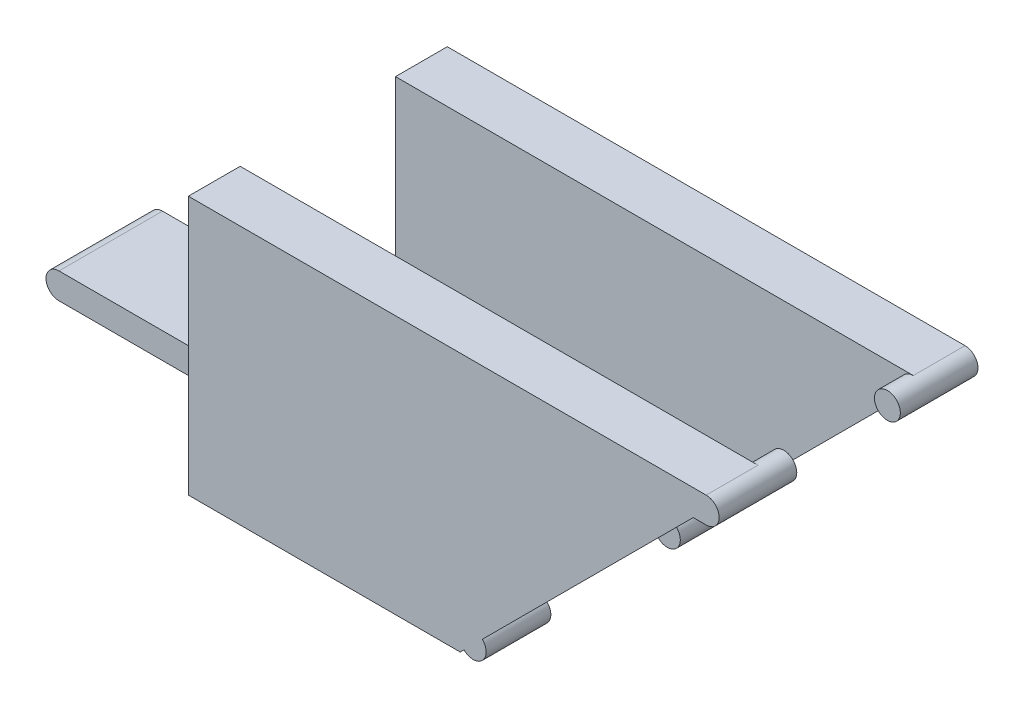
ISO-10303-21;
HEADER;
FILE_DESCRIPTION(('STEP AP214'),'2;1');
FILE_NAME('part.step','',(''),(''),'','','');
FILE_SCHEMA(('AUTOMOTIVE_DESIGN { 1 0 10303 214 1 1 1 1 }'));
ENDSEC;
DATA;
#1=APPLICATION_CONTEXT('core data for automotive mechanical design processes');
#2=APPLICATION_PROTOCOL_DEFINITION('international standard','automotive_design',2000,#1);
#3=PRODUCT_CONTEXT('',#1,'mechanical');
#4=PRODUCT('Part','Part','',(#3));
#5=PRODUCT_RELATED_PRODUCT_CATEGORY('part','',(#4));
#6=PRODUCT_DEFINITION_FORMATION('','',#4);
#7=PRODUCT_DEFINITION_CONTEXT('part definition',#1,'design');
#8=PRODUCT_DEFINITION('design','',#6,#7);
#9=PRODUCT_DEFINITION_SHAPE('','',#8);
#10=(LENGTH_UNIT() NAMED_UNIT(*) SI_UNIT(.MILLI.,.METRE.));
#11=(NAMED_UNIT(*) PLANE_ANGLE_UNIT() SI_UNIT($,.RADIAN.));
#12=(NAMED_UNIT(*) SI_UNIT($,.STERADIAN.) SOLID_ANGLE_UNIT());
#13=UNCERTAINTY_MEASURE_WITH_UNIT(LENGTH_MEASURE(1.E-05),#10,'distance_accuracy_value','');
#14=(GEOMETRIC_REPRESENTATION_CONTEXT(3) GLOBAL_UNCERTAINTY_ASSIGNED_CONTEXT((#13)) GLOBAL_UNIT_ASSIGNED_CONTEXT((#10,
#11,#12)) REPRESENTATION_CONTEXT('',''));
#15=CARTESIAN_POINT('',(0.,0.,0.));
#16=DIRECTION('',(0.,0.,1.));
#17=DIRECTION('',(1.,0.,0.));
#18=AXIS2_PLACEMENT_3D('',#15,#16,#17);
#19=CARTESIAN_POINT('',(37.,18.,-10.));
#20=DIRECTION('',(-0.707106781186553,0.707106781186542,0.));
#21=DIRECTION('',(-0.707106781186542,-0.707106781186553,0.));
#22=AXIS2_PLACEMENT_3D('',#19,#20,#21);
#23=PLANE('',#22);
#24=DIRECTION('',(0.707106781186542,0.707106781186553,0.));
#25=VECTOR('',#24,1.);
#26=CARTESIAN_POINT('',(39.6624393450778,20.6624393450778,-6.));
#27=LINE('',#26,#25);
#28=CARTESIAN_POINT('',(20.7071067811867,1.7071067811864,-6.));
#29=VERTEX_POINT('',#28);
#30=CARTESIAN_POINT('',(37.,18.,-6.));
#31=VERTEX_POINT('',#30);
#32=EDGE_CURVE('E210',#29,#31,#27,.T.);
#33=ORIENTED_EDGE('',*,*,#32,.F.);
#34=DIRECTION('',(0.,0.,-1.));
#35=VECTOR('',#34,1.);
#36=CARTESIAN_POINT('',(20.7071067811867,1.7071067811864,-5.));
#37=LINE('',#36,#35);
#38=CARTESIAN_POINT('',(20.7071067811867,1.7071067811864,-10.));
#39=VERTEX_POINT('',#38);
#40=EDGE_CURVE('E11',#29,#39,#37,.T.);
#41=ORIENTED_EDGE('',*,*,#40,.T.);
#42=DIRECTION('',(-0.707106781186542,-0.707106781186553,0.));
#43=VECTOR('',#42,1.);
#44=CARTESIAN_POINT('',(37.,18.,-10.));
#45=LINE('',#44,#43);
#46=CARTESIAN_POINT('',(37.,18.,-10.));
#47=VERTEX_POINT('',#46);
#48=EDGE_CURVE('E208',#47,#39,#45,.T.);
#49=ORIENTED_EDGE('',*,*,#48,.F.);
#50=DIRECTION('',(0.,0.,1.));
#51=VECTOR('',#50,1.);
#52=CARTESIAN_POINT('',(37.,18.,-10.));
#53=LINE('',#52,#51);
#54=EDGE_CURVE('E227',#47,#31,#53,.T.);
#55=ORIENTED_EDGE('',*,*,#54,.T.);
#56=EDGE_LOOP('',(#33,#41,#49,#55));
#57=FACE_BOUND('',#56,.T.);
#58=ADVANCED_FACE('F38',(#57),#23,.F.);
#59=DIRECTION('',(-0.707106781186542,-0.707106781186553,0.));
#60=VECTOR('',#59,1.);
#61=CARTESIAN_POINT('',(39.6624393450778,20.6624393450778,6.));
#62=LINE('',#61,#60);
#63=CARTESIAN_POINT('',(19.2928932188136,0.292893218813289,6.));
#64=VERTEX_POINT('',#63);
#65=CARTESIAN_POINT('',(19.0000000000003,0.,6.));
#66=VERTEX_POINT('',#65);
#67=EDGE_CURVE('E368',#64,#66,#62,.T.);
#68=ORIENTED_EDGE('',*,*,#67,.F.);
#69=DIRECTION('',(0.,0.,1.));
#70=VECTOR('',#69,1.);
#71=CARTESIAN_POINT('',(19.2928932188136,0.292893218813291,5.));
#72=LINE('',#71,#70);
#73=CARTESIAN_POINT('',(19.2928932188136,0.292893218813291,10.));
#74=VERTEX_POINT('',#73);
#75=EDGE_CURVE('E373',#64,#74,#72,.T.);
#76=ORIENTED_EDGE('',*,*,#75,.T.);
#77=DIRECTION('',(-0.707106781186542,-0.707106781186553,0.));
#78=VECTOR('',#77,1.);
#79=CARTESIAN_POINT('',(37.,18.,10.));
#80=LINE('',#79,#78);
#81=CARTESIAN_POINT('',(19.0000000000003,0.,10.));
#82=VERTEX_POINT('',#81);
#83=EDGE_CURVE('E224',#74,#82,#80,.T.);
#84=ORIENTED_EDGE('',*,*,#83,.T.);
#85=DIRECTION('',(0.,0.,1.));
#86=VECTOR('',#85,1.);
#87=CARTESIAN_POINT('',(19.0000000000003,0.,-10.));
#88=LINE('',#87,#86);
#89=EDGE_CURVE('E216',#66,#82,#88,.T.);
#90=ORIENTED_EDGE('',*,*,#89,.F.);
#91=EDGE_LOOP('',(#68,#76,#84,#90));
#92=FACE_BOUND('',#91,.T.);
#93=ADVANCED_FACE('F486',(#92),#23,.F.);
#94=CARTESIAN_POINT('',(38.,19.,10.));
#95=DIRECTION('',(0.,0.,-1.));
#96=DIRECTION('',(-1.,0.,0.));
#97=AXIS2_PLACEMENT_3D('',#94,#95,#96);
#98=CYLINDRICAL_SURFACE('',#97,0.999999999999998);
#99=CARTESIAN_POINT('',(38.,19.,4.00000000000001));
#100=DIRECTION('',(0.,0.,1.));
#101=DIRECTION('',(1.,0.,0.));
#102=AXIS2_PLACEMENT_3D('',#99,#100,#101);
#103=CIRCLE('',#102,0.999999999999998);
#104=CARTESIAN_POINT('',(39.,19.,4.00000000000001));
#105=VERTEX_POINT('',#104);
#106=EDGE_CURVE('E266',#105,#105,#103,.T.);
#107=ORIENTED_EDGE('',*,*,#106,.T.);
#108=EDGE_LOOP('',(#107));
#109=FACE_BOUND('',#108,.T.);
#110=CARTESIAN_POINT('',(38.,19.,10.));
#111=DIRECTION('',(0.,0.,1.));
#112=DIRECTION('',(1.,0.,0.));
#113=AXIS2_PLACEMENT_3D('',#110,#111,#112);
#114=CIRCLE('',#113,0.999999999999998);
#115=CARTESIAN_POINT('',(38.,18.,10.));
#116=VERTEX_POINT('',#115);
#117=CARTESIAN_POINT('',(38.,20.,10.));
#118=VERTEX_POINT('',#117);
#119=EDGE_CURVE('E270',#116,#118,#114,.T.);
#120=ORIENTED_EDGE('',*,*,#119,.F.);
#121=DIRECTION('',(0.,0.,-1.));
#122=VECTOR('',#121,1.);
#123=CARTESIAN_POINT('',(38.,18.,10.));
#124=LINE('',#123,#122);
#125=CARTESIAN_POINT('',(38.,18.,6.));
#126=VERTEX_POINT('',#125);
#127=EDGE_CURVE('E273',#116,#126,#124,.T.);
#128=ORIENTED_EDGE('',*,*,#127,.T.);
#129=CARTESIAN_POINT('',(38.,19.,6.));
#130=DIRECTION('',(0.,0.,1.));
#131=DIRECTION('',(0.,-1.,0.));
#132=AXIS2_PLACEMENT_3D('',#129,#130,#131);
#133=CIRCLE('',#132,0.999999999999998);
#134=CARTESIAN_POINT('',(38.,20.,6.));
#135=VERTEX_POINT('',#134);
#136=EDGE_CURVE('E362',#126,#135,#133,.F.);
#137=ORIENTED_EDGE('',*,*,#136,.T.);
#138=DIRECTION('',(0.,0.,-1.));
#139=VECTOR('',#138,1.);
#140=CARTESIAN_POINT('',(38.,20.,-10.));
#141=LINE('',#140,#139);
#142=EDGE_CURVE('E339',#118,#135,#141,.T.);
#143=ORIENTED_EDGE('',*,*,#142,.F.);
#144=EDGE_LOOP('',(#120,#128,#137,#143));
#145=FACE_BOUND('',#144,.T.);
#146=ADVANCED_FACE('F453',(#109,#145),#98,.T.);
#147=CARTESIAN_POINT('',(-18.,4.,-4.));
#148=DIRECTION('',(0.,-1.,0.));
#149=DIRECTION('',(0.,0.,-1.));
#150=AXIS2_PLACEMENT_3D('',#147,#148,#149);
#151=PLANE('',#150);
#152=DIRECTION('',(0.,0.,1.));
#153=VECTOR('',#152,1.);
#154=CARTESIAN_POINT('',(18.,4.,5.99999999999999));
#155=LINE('',#154,#153);
#156=CARTESIAN_POINT('',(18.,4.,-6.00000000000001));
#157=VERTEX_POINT('',#156);
#158=CARTESIAN_POINT('',(18.,4.,6.));
#159=VERTEX_POINT('',#158);
#160=EDGE_CURVE('E292',#157,#159,#155,.T.);
#161=ORIENTED_EDGE('',*,*,#160,.F.);
#162=DIRECTION('',(-1.,0.,0.));
#163=VECTOR('',#162,1.);
#164=CARTESIAN_POINT('',(38.,4.,-6.));
#165=LINE('',#164,#163);
#166=CARTESIAN_POINT('',(-1.99999999999999,4.,-6.));
#167=VERTEX_POINT('',#166);
#168=EDGE_CURVE('E308',#157,#167,#165,.T.);
#169=ORIENTED_EDGE('',*,*,#168,.T.);
#170=DIRECTION('',(0.,0.,1.));
#171=VECTOR('',#170,1.);
#172=CARTESIAN_POINT('',(-1.99999999999999,4.,-6.));
#173=LINE('',#172,#171);
#174=CARTESIAN_POINT('',(-1.99999999999999,4.,-4.));
#175=VERTEX_POINT('',#174);
#176=EDGE_CURVE('E304',#167,#175,#173,.T.);
#177=ORIENTED_EDGE('',*,*,#176,.T.);
#178=DIRECTION('',(1.,0.,0.));
#179=VECTOR('',#178,1.);
#180=CARTESIAN_POINT('',(-18.,4.,-4.));
#181=LINE('',#180,#179);
#182=CARTESIAN_POINT('',(-18.,4.,-4.));
#183=VERTEX_POINT('',#182);
#184=EDGE_CURVE('E316',#183,#175,#181,.T.);
#185=ORIENTED_EDGE('',*,*,#184,.F.);
#186=DIRECTION('',(0.,0.,-1.));
#187=VECTOR('',#186,1.);
#188=CARTESIAN_POINT('',(-18.,4.,-4.));
#189=LINE('',#188,#187);
#190=CARTESIAN_POINT('',(-18.,4.,4.));
#191=VERTEX_POINT('',#190);
#192=EDGE_CURVE('E313',#191,#183,#189,.T.);
#193=ORIENTED_EDGE('',*,*,#192,.F.);
#194=DIRECTION('',(1.,0.,0.));
#195=VECTOR('',#194,1.);
#196=CARTESIAN_POINT('',(-18.,4.,4.));
#197=LINE('',#196,#195);
#198=CARTESIAN_POINT('',(-1.99999999999999,4.,4.));
#199=VERTEX_POINT('',#198);
#200=EDGE_CURVE('E324',#191,#199,#197,.T.);
#201=ORIENTED_EDGE('',*,*,#200,.T.);
#202=CARTESIAN_POINT('',(-1.99999999999999,4.,6.));
#203=VERTEX_POINT('',#202);
#204=EDGE_CURVE('E303',#199,#203,#173,.T.);
#205=ORIENTED_EDGE('',*,*,#204,.T.);
#206=DIRECTION('',(-1.,0.,0.));
#207=VECTOR('',#206,1.);
#208=CARTESIAN_POINT('',(38.,4.,6.));
#209=LINE('',#208,#207);
#210=EDGE_CURVE('E309',#159,#203,#209,.T.);
#211=ORIENTED_EDGE('',*,*,#210,.F.);
#212=EDGE_LOOP('',(#161,#169,#177,#185,#193,#201,#205,#211));
#213=FACE_BOUND('',#212,.T.);
#214=ADVANCED_FACE('F407',(#213),#151,.F.);
#215=CARTESIAN_POINT('',(-1.99999999999999,20.,-10.));
#216=DIRECTION('',(1.,0.,0.));
#217=DIRECTION('',(0.,0.,-1.));
#218=AXIS2_PLACEMENT_3D('',#215,#216,#217);
#219=PLANE('',#218);
#220=DIRECTION('',(0.,0.,1.));
#221=VECTOR('',#220,1.);
#222=CARTESIAN_POINT('',(-1.99999999999999,20.,-10.));
#223=LINE('',#222,#221);
#224=CARTESIAN_POINT('',(-1.99999999999999,20.,6.));
#225=VERTEX_POINT('',#224);
#226=CARTESIAN_POINT('',(-1.99999999999999,20.,10.));
#227=VERTEX_POINT('',#226);
#228=EDGE_CURVE('E336',#225,#227,#223,.T.);
#229=ORIENTED_EDGE('',*,*,#228,.F.);
#230=DIRECTION('',(0.,1.,0.));
#231=VECTOR('',#230,1.);
#232=CARTESIAN_POINT('',(-1.99999999999999,22.3248786901555,6.));
#233=LINE('',#232,#231);
#234=EDGE_CURVE('E306',#203,#225,#233,.T.);
#235=ORIENTED_EDGE('',*,*,#234,.F.);
#236=ORIENTED_EDGE('',*,*,#204,.F.);
#237=DIRECTION('',(0.,1.,0.));
#238=VECTOR('',#237,1.);
#239=CARTESIAN_POINT('',(-1.99999999999999,0.,4.));
#240=LINE('',#239,#238);
#241=CARTESIAN_POINT('',(-1.99999999999999,0.,4.));
#242=VERTEX_POINT('',#241);
#243=EDGE_CURVE('E317',#242,#199,#240,.T.);
#244=ORIENTED_EDGE('',*,*,#243,.F.);
#245=DIRECTION('',(0.,0.,1.));
#246=VECTOR('',#245,1.);
#247=CARTESIAN_POINT('',(-1.99999999999999,0.,-10.));
#248=LINE('',#247,#246);
#249=CARTESIAN_POINT('',(-1.99999999999999,0.,10.));
#250=VERTEX_POINT('',#249);
#251=EDGE_CURVE('E331',#242,#250,#248,.T.);
#252=ORIENTED_EDGE('',*,*,#251,.T.);
#253=DIRECTION('',(0.,-1.,0.));
#254=VECTOR('',#253,1.);
#255=CARTESIAN_POINT('',(-1.99999999999999,20.,10.));
#256=LINE('',#255,#254);
#257=EDGE_CURVE('E354',#227,#250,#256,.T.);
#258=ORIENTED_EDGE('',*,*,#257,.F.);
#259=EDGE_LOOP('',(#229,#235,#236,#244,#252,#258));
#260=FACE_BOUND('',#259,.T.);
#261=ADVANCED_FACE('F427',(#260),#219,.F.);
#262=CARTESIAN_POINT('',(0.,20.,0.));
#263=DIRECTION('',(0.,1.,0.));
#264=DIRECTION('',(0.,0.,1.));
#265=AXIS2_PLACEMENT_3D('',#262,#263,#264);
#266=PLANE('',#265);
#267=DIRECTION('',(-1.,0.,0.));
#268=VECTOR('',#267,1.);
#269=CARTESIAN_POINT('',(0.,20.,-6.));
#270=LINE('',#269,#268);
#271=CARTESIAN_POINT('',(38.,20.,-6.));
#272=VERTEX_POINT('',#271);
#273=CARTESIAN_POINT('',(-1.99999999999999,20.,-6.));
#274=VERTEX_POINT('',#273);
#275=EDGE_CURVE('E360',#272,#274,#270,.T.);
#276=ORIENTED_EDGE('',*,*,#275,.F.);
#277=CARTESIAN_POINT('',(38.,20.,-10.));
#278=VERTEX_POINT('',#277);
#279=EDGE_CURVE('E338',#272,#278,#141,.T.);
#280=ORIENTED_EDGE('',*,*,#279,.T.);
#281=DIRECTION('',(-1.,0.,0.));
#282=VECTOR('',#281,1.);
#283=CARTESIAN_POINT('',(-1.99999999999999,20.,-10.));
#284=LINE('',#283,#282);
#285=CARTESIAN_POINT('',(-1.99999999999999,20.,-10.));
#286=VERTEX_POINT('',#285);
#287=EDGE_CURVE('E341',#278,#286,#284,.T.);
#288=ORIENTED_EDGE('',*,*,#287,.T.);
#289=EDGE_CURVE('E332',#286,#274,#223,.T.);
#290=ORIENTED_EDGE('',*,*,#289,.T.);
#291=EDGE_LOOP('',(#276,#280,#288,#290));
#292=FACE_BOUND('',#291,.T.);
#293=ADVANCED_FACE('F397',(#292),#266,.T.);
#294=ORIENTED_EDGE('',*,*,#176,.F.);
#295=DIRECTION('',(0.,-1.,0.));
#296=VECTOR('',#295,1.);
#297=CARTESIAN_POINT('',(-1.99999999999999,22.3248786901555,-6.));
#298=LINE('',#297,#296);
#299=EDGE_CURVE('E298',#274,#167,#298,.T.);
#300=ORIENTED_EDGE('',*,*,#299,.F.);
#301=ORIENTED_EDGE('',*,*,#289,.F.);
#302=DIRECTION('',(0.,-1.,0.));
#303=VECTOR('',#302,1.);
#304=CARTESIAN_POINT('',(-1.99999999999999,20.,-10.));
#305=LINE('',#304,#303);
#306=CARTESIAN_POINT('',(-1.99999999999999,0.,-10.));
#307=VERTEX_POINT('',#306);
#308=EDGE_CURVE('E343',#286,#307,#305,.T.);
#309=ORIENTED_EDGE('',*,*,#308,.T.);
#310=CARTESIAN_POINT('',(-1.99999999999999,0.,-4.));
#311=VERTEX_POINT('',#310);
#312=EDGE_CURVE('E344',#307,#311,#248,.T.);
#313=ORIENTED_EDGE('',*,*,#312,.T.);
#314=DIRECTION('',(0.,-1.,0.));
#315=VECTOR('',#314,1.);
#316=CARTESIAN_POINT('',(-1.99999999999999,0.,-4.));
#317=LINE('',#316,#315);
#318=EDGE_CURVE('E311',#175,#311,#317,.T.);
#319=ORIENTED_EDGE('',*,*,#318,.F.);
#320=EDGE_LOOP('',(#294,#300,#301,#309,#313,#319));
#321=FACE_BOUND('',#320,.T.);
#322=ADVANCED_FACE('F40',(#321),#219,.F.);
#323=CARTESIAN_POINT('',(-1.99999999999999,20.,10.));
#324=DIRECTION('',(0.,0.,-1.));
#325=DIRECTION('',(-1.,0.,0.));
#326=AXIS2_PLACEMENT_3D('',#323,#324,#325);
#327=PLANE('',#326);
#328=ORIENTED_EDGE('',*,*,#83,.F.);
#329=CARTESIAN_POINT('',(20.,1.,10.));
#330=DIRECTION('',(0.,0.,1.));
#331=DIRECTION('',(1.,0.,0.));
#332=AXIS2_PLACEMENT_3D('',#329,#330,#331);
#333=CIRCLE('',#332,1.);
#334=CARTESIAN_POINT('',(20.7071067811867,1.7071067811864,10.));
#335=VERTEX_POINT('',#334);
#336=EDGE_CURVE('E467',#74,#335,#333,.T.);
#337=ORIENTED_EDGE('',*,*,#336,.T.);
#338=CARTESIAN_POINT('',(37.,18.,10.));
#339=VERTEX_POINT('',#338);
#340=EDGE_CURVE('E222',#339,#335,#80,.T.);
#341=ORIENTED_EDGE('',*,*,#340,.F.);
#342=DIRECTION('',(-1.,0.,0.));
#343=VECTOR('',#342,1.);
#344=CARTESIAN_POINT('',(38.,18.,10.));
#345=LINE('',#344,#343);
#346=EDGE_CURVE('E218',#116,#339,#345,.T.);
#347=ORIENTED_EDGE('',*,*,#346,.F.);
#348=ORIENTED_EDGE('',*,*,#119,.T.);
#349=DIRECTION('',(1.,0.,0.));
#350=VECTOR('',#349,1.);
#351=CARTESIAN_POINT('',(-1.99999999999999,20.,10.));
#352=LINE('',#351,#350);
#353=EDGE_CURVE('E335',#227,#118,#352,.T.);
#354=ORIENTED_EDGE('',*,*,#353,.F.);
#355=ORIENTED_EDGE('',*,*,#257,.T.);
#356=DIRECTION('',(1.,0.,0.));
#357=VECTOR('',#356,1.);
#358=CARTESIAN_POINT('',(-1.99999999999999,0.,10.));
#359=LINE('',#358,#357);
#360=EDGE_CURVE('E347',#250,#82,#359,.T.);
#361=ORIENTED_EDGE('',*,*,#360,.T.);
#362=EDGE_LOOP('',(#328,#337,#341,#347,#348,#354,#355,#361));
#363=FACE_BOUND('',#362,.T.);
#364=ADVANCED_FACE('F421',(#363),#327,.F.);
#365=CARTESIAN_POINT('',(-1.99999999999999,20.,-10.));
#366=DIRECTION('',(0.,0.,1.));
#367=DIRECTION('',(1.,0.,0.));
#368=AXIS2_PLACEMENT_3D('',#365,#366,#367);
#369=PLANE('',#368);
#370=ORIENTED_EDGE('',*,*,#48,.T.);
#371=CARTESIAN_POINT('',(20.,1.,-10.));
#372=DIRECTION('',(0.,0.,-1.));
#373=DIRECTION('',(-1.,0.,0.));
#374=AXIS2_PLACEMENT_3D('',#371,#372,#373);
#375=CIRCLE('',#374,1.);
#376=CARTESIAN_POINT('',(19.2928932188136,0.292893218813293,-10.));
#377=VERTEX_POINT('',#376);
#378=EDGE_CURVE('E53',#39,#377,#375,.T.);
#379=ORIENTED_EDGE('',*,*,#378,.T.);
#380=CARTESIAN_POINT('',(19.0000000000003,0.,-10.));
#381=VERTEX_POINT('',#380);
#382=EDGE_CURVE('E214',#377,#381,#45,.T.);
#383=ORIENTED_EDGE('',*,*,#382,.T.);
#384=DIRECTION('',(-1.,0.,0.));
#385=VECTOR('',#384,1.);
#386=CARTESIAN_POINT('',(-1.99999999999999,0.,-10.));
#387=LINE('',#386,#385);
#388=EDGE_CURVE('E350',#381,#307,#387,.T.);
#389=ORIENTED_EDGE('',*,*,#388,.T.);
#390=ORIENTED_EDGE('',*,*,#308,.F.);
#391=ORIENTED_EDGE('',*,*,#287,.F.);
#392=CARTESIAN_POINT('',(38.,19.,-10.));
#393=DIRECTION('',(0.,0.,1.));
#394=DIRECTION('',(1.,0.,0.));
#395=AXIS2_PLACEMENT_3D('',#392,#393,#394);
#396=CIRCLE('',#395,0.999999999999998);
#397=CARTESIAN_POINT('',(38.,18.,-10.));
#398=VERTEX_POINT('',#397);
#399=EDGE_CURVE('E269',#398,#278,#396,.T.);
#400=ORIENTED_EDGE('',*,*,#399,.F.);
#401=DIRECTION('',(-1.,0.,0.));
#402=VECTOR('',#401,1.);
#403=CARTESIAN_POINT('',(38.,18.,-10.));
#404=LINE('',#403,#402);
#405=EDGE_CURVE('E213',#398,#47,#404,.T.);
#406=ORIENTED_EDGE('',*,*,#405,.T.);
#407=EDGE_LOOP('',(#370,#379,#383,#389,#390,#391,#400,#406));
#408=FACE_BOUND('',#407,.T.);
#409=ADVANCED_FACE('F211',(#408),#369,.F.);
#410=DIRECTION('',(1.,0.,0.));
#411=VECTOR('',#410,1.);
#412=CARTESIAN_POINT('',(0.,20.,6.));
#413=LINE('',#412,#411);
#414=EDGE_CURVE('E357',#225,#135,#413,.T.);
#415=ORIENTED_EDGE('',*,*,#414,.F.);
#416=ORIENTED_EDGE('',*,*,#228,.T.);
#417=ORIENTED_EDGE('',*,*,#353,.T.);
#418=ORIENTED_EDGE('',*,*,#142,.T.);
#419=EDGE_LOOP('',(#415,#416,#417,#418));
#420=FACE_BOUND('',#419,.T.);
#421=ADVANCED_FACE('F449',(#420),#266,.T.);
#422=CARTESIAN_POINT('',(0.,0.,0.));
#423=DIRECTION('',(0.,1.,0.));
#424=DIRECTION('',(0.,0.,1.));
#425=AXIS2_PLACEMENT_3D('',#422,#423,#424);
#426=PLANE('',#425);
#427=ORIENTED_EDGE('',*,*,#388,.F.);
#428=CARTESIAN_POINT('',(19.0000000000003,0.,-6.));
#429=VERTEX_POINT('',#428);
#430=EDGE_CURVE('E231',#381,#429,#88,.T.);
#431=ORIENTED_EDGE('',*,*,#430,.T.);
#432=DIRECTION('',(1.,0.,0.));
#433=VECTOR('',#432,1.);
#434=CARTESIAN_POINT('',(18.,0.,-6.00000000000001));
#435=LINE('',#434,#433);
#436=CARTESIAN_POINT('',(18.,0.,-6.00000000000001));
#437=VERTEX_POINT('',#436);
#438=EDGE_CURVE('E295',#437,#429,#435,.T.);
#439=ORIENTED_EDGE('',*,*,#438,.F.);
#440=DIRECTION('',(0.,0.,-1.));
#441=VECTOR('',#440,1.);
#442=CARTESIAN_POINT('',(18.,0.,5.99999999999999));
#443=LINE('',#442,#441);
#444=CARTESIAN_POINT('',(18.,0.,5.99999999999999));
#445=VERTEX_POINT('',#444);
#446=EDGE_CURVE('E287',#445,#437,#443,.T.);
#447=ORIENTED_EDGE('',*,*,#446,.F.);
#448=DIRECTION('',(1.,0.,0.));
#449=VECTOR('',#448,1.);
#450=CARTESIAN_POINT('',(18.,0.,5.99999999999999));
#451=LINE('',#450,#449);
#452=EDGE_CURVE('E294',#445,#66,#451,.T.);
#453=ORIENTED_EDGE('',*,*,#452,.T.);
#454=ORIENTED_EDGE('',*,*,#89,.T.);
#455=ORIENTED_EDGE('',*,*,#360,.F.);
#456=ORIENTED_EDGE('',*,*,#251,.F.);
#457=DIRECTION('',(1.,0.,0.));
#458=VECTOR('',#457,1.);
#459=CARTESIAN_POINT('',(-18.,0.,4.));
#460=LINE('',#459,#458);
#461=CARTESIAN_POINT('',(-5.,0.,4.));
#462=VERTEX_POINT('',#461);
#463=EDGE_CURVE('E327',#462,#242,#460,.T.);
#464=ORIENTED_EDGE('',*,*,#463,.F.);
#465=DIRECTION('',(0.,0.,1.));
#466=VECTOR('',#465,1.);
#467=CARTESIAN_POINT('',(-5.,0.,-16.));
#468=LINE('',#467,#466);
#469=CARTESIAN_POINT('',(-5.,0.,-4.));
#470=VERTEX_POINT('',#469);
#471=EDGE_CURVE('E254',#470,#462,#468,.T.);
#472=ORIENTED_EDGE('',*,*,#471,.F.);
#473=DIRECTION('',(1.,0.,0.));
#474=VECTOR('',#473,1.);
#475=CARTESIAN_POINT('',(-18.,0.,-4.));
#476=LINE('',#475,#474);
#477=EDGE_CURVE('E329',#470,#311,#476,.T.);
#478=ORIENTED_EDGE('',*,*,#477,.T.);
#479=ORIENTED_EDGE('',*,*,#312,.F.);
#480=EDGE_LOOP('',(#427,#431,#439,#447,#453,#454,#455,#456,#464,#472,#478,#479));
#481=FACE_BOUND('',#480,.T.);
#482=ADVANCED_FACE('F386',(#481),#426,.F.);
#483=CARTESIAN_POINT('',(-18.,0.,-4.));
#484=DIRECTION('',(0.,0.,1.));
#485=DIRECTION('',(1.,0.,0.));
#486=AXIS2_PLACEMENT_3D('',#483,#484,#485);
#487=PLANE('',#486);
#488=DIRECTION('',(-1.,0.,0.));
#489=VECTOR('',#488,1.);
#490=CARTESIAN_POINT('',(-18.,2.,-4.));
#491=LINE('',#490,#489);
#492=CARTESIAN_POINT('',(-5.,2.,-4.));
#493=VERTEX_POINT('',#492);
#494=CARTESIAN_POINT('',(-18.,2.,-4.));
#495=VERTEX_POINT('',#494);
#496=EDGE_CURVE('E256',#493,#495,#491,.T.);
#497=ORIENTED_EDGE('',*,*,#496,.T.);
#498=CARTESIAN_POINT('',(-18.,3.,-4.));
#499=DIRECTION('',(0.,0.,1.));
#500=DIRECTION('',(1.,0.,0.));
#501=AXIS2_PLACEMENT_3D('',#498,#499,#500);
#502=CIRCLE('',#501,1.);
#503=EDGE_CURVE('E243',#183,#495,#502,.T.);
#504=ORIENTED_EDGE('',*,*,#503,.F.);
#505=ORIENTED_EDGE('',*,*,#184,.T.);
#506=ORIENTED_EDGE('',*,*,#318,.T.);
#507=ORIENTED_EDGE('',*,*,#477,.F.);
#508=CARTESIAN_POINT('',(-5.,1.,-4.));
#509=DIRECTION('',(0.,0.,1.));
#510=DIRECTION('',(1.,0.,0.));
#511=AXIS2_PLACEMENT_3D('',#508,#509,#510);
#512=CIRCLE('',#511,1.);
#513=EDGE_CURVE('E260',#470,#493,#512,.F.);
#514=ORIENTED_EDGE('',*,*,#513,.T.);
#515=EDGE_LOOP('',(#497,#504,#505,#506,#507,#514));
#516=FACE_BOUND('',#515,.T.);
#517=ADVANCED_FACE('F441',(#516),#487,.F.);
#518=CARTESIAN_POINT('',(-18.,0.,4.));
#519=DIRECTION('',(0.,0.,-1.));
#520=DIRECTION('',(-1.,0.,0.));
#521=AXIS2_PLACEMENT_3D('',#518,#519,#520);
#522=PLANE('',#521);
#523=ORIENTED_EDGE('',*,*,#200,.F.);
#524=CARTESIAN_POINT('',(-18.,3.,4.));
#525=DIRECTION('',(0.,0.,1.));
#526=DIRECTION('',(1.,0.,0.));
#527=AXIS2_PLACEMENT_3D('',#524,#525,#526);
#528=CIRCLE('',#527,1.);
#529=CARTESIAN_POINT('',(-18.,2.,4.));
#530=VERTEX_POINT('',#529);
#531=EDGE_CURVE('E242',#191,#530,#528,.T.);
#532=ORIENTED_EDGE('',*,*,#531,.T.);
#533=DIRECTION('',(-1.,0.,0.));
#534=VECTOR('',#533,1.);
#535=CARTESIAN_POINT('',(-5.,2.,4.));
#536=LINE('',#535,#534);
#537=CARTESIAN_POINT('',(-5.,2.,4.));
#538=VERTEX_POINT('',#537);
#539=EDGE_CURVE('E251',#538,#530,#536,.T.);
#540=ORIENTED_EDGE('',*,*,#539,.F.);
#541=CARTESIAN_POINT('',(-5.,1.,4.));
#542=DIRECTION('',(0.,0.,-1.));
#543=DIRECTION('',(1.,0.,0.));
#544=AXIS2_PLACEMENT_3D('',#541,#542,#543);
#545=CIRCLE('',#544,1.);
#546=EDGE_CURVE('E246',#462,#538,#545,.T.);
#547=ORIENTED_EDGE('',*,*,#546,.F.);
#548=ORIENTED_EDGE('',*,*,#463,.T.);
#549=ORIENTED_EDGE('',*,*,#243,.T.);
#550=EDGE_LOOP('',(#523,#532,#540,#547,#548,#549));
#551=FACE_BOUND('',#550,.T.);
#552=ADVANCED_FACE('F435',(#551),#522,.F.);
#553=CARTESIAN_POINT('',(38.,22.3248786901555,-6.));
#554=DIRECTION('',(0.,0.,-1.));
#555=DIRECTION('',(0.,1.,0.));
#556=AXIS2_PLACEMENT_3D('',#553,#554,#555);
#557=PLANE('',#556);
#558=CARTESIAN_POINT('',(19.2928932188136,0.292893218813291,-6.));
#559=VERTEX_POINT('',#558);
#560=EDGE_CURVE('E239',#429,#559,#27,.T.);
#561=ORIENTED_EDGE('',*,*,#560,.T.);
#562=CARTESIAN_POINT('',(20.,1.,-6.));
#563=DIRECTION('',(0.,0.,-1.));
#564=DIRECTION('',(0.,1.,0.));
#565=AXIS2_PLACEMENT_3D('',#562,#563,#564);
#566=CIRCLE('',#565,1.);
#567=EDGE_CURVE('E380',#559,#29,#566,.T.);
#568=ORIENTED_EDGE('',*,*,#567,.T.);
#569=ORIENTED_EDGE('',*,*,#32,.T.);
#570=DIRECTION('',(1.,0.,0.));
#571=VECTOR('',#570,1.);
#572=CARTESIAN_POINT('',(38.,18.,-6.));
#573=LINE('',#572,#571);
#574=CARTESIAN_POINT('',(38.,18.,-6.));
#575=VERTEX_POINT('',#574);
#576=EDGE_CURVE('E236',#31,#575,#573,.T.);
#577=ORIENTED_EDGE('',*,*,#576,.T.);
#578=CARTESIAN_POINT('',(38.,19.,-6.));
#579=DIRECTION('',(0.,0.,-1.));
#580=DIRECTION('',(0.,1.,0.));
#581=AXIS2_PLACEMENT_3D('',#578,#579,#580);
#582=CIRCLE('',#581,0.999999999999998);
#583=EDGE_CURVE('E278',#272,#575,#582,.F.);
#584=ORIENTED_EDGE('',*,*,#583,.F.);
#585=ORIENTED_EDGE('',*,*,#275,.T.);
#586=ORIENTED_EDGE('',*,*,#299,.T.);
#587=ORIENTED_EDGE('',*,*,#168,.F.);
#588=DIRECTION('',(0.,1.,0.));
#589=VECTOR('',#588,1.);
#590=CARTESIAN_POINT('',(18.,4.,-6.00000000000001));
#591=LINE('',#590,#589);
#592=EDGE_CURVE('E290',#437,#157,#591,.T.);
#593=ORIENTED_EDGE('',*,*,#592,.F.);
#594=ORIENTED_EDGE('',*,*,#438,.T.);
#595=EDGE_LOOP('',(#561,#568,#569,#577,#584,#585,#586,#587,#593,#594));
#596=FACE_BOUND('',#595,.T.);
#597=ADVANCED_FACE('F379',(#596),#557,.F.);
#598=CARTESIAN_POINT('',(38.,22.3248786901555,6.));
#599=DIRECTION('',(0.,0.,1.));
#600=DIRECTION('',(0.,-1.,0.));
#601=AXIS2_PLACEMENT_3D('',#598,#599,#600);
#602=PLANE('',#601);
#603=CARTESIAN_POINT('',(37.,18.,6.));
#604=VERTEX_POINT('',#603);
#605=CARTESIAN_POINT('',(20.7071067811867,1.7071067811864,6.));
#606=VERTEX_POINT('',#605);
#607=EDGE_CURVE('E369',#604,#606,#62,.T.);
#608=ORIENTED_EDGE('',*,*,#607,.T.);
#609=CARTESIAN_POINT('',(20.,1.,6.));
#610=DIRECTION('',(0.,0.,1.));
#611=DIRECTION('',(0.,-1.,0.));
#612=AXIS2_PLACEMENT_3D('',#609,#610,#611);
#613=CIRCLE('',#612,1.);
#614=EDGE_CURVE('E61',#606,#64,#613,.T.);
#615=ORIENTED_EDGE('',*,*,#614,.T.);
#616=ORIENTED_EDGE('',*,*,#67,.T.);
#617=ORIENTED_EDGE('',*,*,#452,.F.);
#618=DIRECTION('',(0.,-1.,0.));
#619=VECTOR('',#618,1.);
#620=CARTESIAN_POINT('',(18.,4.,5.99999999999999));
#621=LINE('',#620,#619);
#622=EDGE_CURVE('E284',#159,#445,#621,.T.);
#623=ORIENTED_EDGE('',*,*,#622,.F.);
#624=ORIENTED_EDGE('',*,*,#210,.T.);
#625=ORIENTED_EDGE('',*,*,#234,.T.);
#626=ORIENTED_EDGE('',*,*,#414,.T.);
#627=ORIENTED_EDGE('',*,*,#136,.F.);
#628=DIRECTION('',(-1.,0.,0.));
#629=VECTOR('',#628,1.);
#630=CARTESIAN_POINT('',(38.,18.,6.));
#631=LINE('',#630,#629);
#632=EDGE_CURVE('E229',#126,#604,#631,.T.);
#633=ORIENTED_EDGE('',*,*,#632,.T.);
#634=EDGE_LOOP('',(#608,#615,#616,#617,#623,#624,#625,#626,#627,#633));
#635=FACE_BOUND('',#634,.T.);
#636=ADVANCED_FACE('F414',(#635),#602,.F.);
#637=CARTESIAN_POINT('',(18.,0.,0.));
#638=DIRECTION('',(1.,0.,0.));
#639=DIRECTION('',(0.,0.,-1.));
#640=AXIS2_PLACEMENT_3D('',#637,#638,#639);
#641=PLANE('',#640);
#642=ORIENTED_EDGE('',*,*,#622,.T.);
#643=ORIENTED_EDGE('',*,*,#446,.T.);
#644=ORIENTED_EDGE('',*,*,#592,.T.);
#645=ORIENTED_EDGE('',*,*,#160,.T.);
#646=EDGE_LOOP('',(#642,#643,#644,#645));
#647=FACE_BOUND('',#646,.T.);
#648=ADVANCED_FACE('F413',(#647),#641,.T.);
#649=ORIENTED_EDGE('',*,*,#583,.T.);
#650=DIRECTION('',(0.,0.,-1.));
#651=VECTOR('',#650,1.);
#652=CARTESIAN_POINT('',(38.,18.,10.));
#653=LINE('',#652,#651);
#654=EDGE_CURVE('E281',#575,#398,#653,.T.);
#655=ORIENTED_EDGE('',*,*,#654,.T.);
#656=ORIENTED_EDGE('',*,*,#399,.T.);
#657=ORIENTED_EDGE('',*,*,#279,.F.);
#658=EDGE_LOOP('',(#649,#655,#656,#657));
#659=FACE_BOUND('',#658,.T.);
#660=CARTESIAN_POINT('',(38.,19.,-3.99999999999999));
#661=DIRECTION('',(0.,0.,-1.));
#662=DIRECTION('',(-1.,0.,0.));
#663=AXIS2_PLACEMENT_3D('',#660,#661,#662);
#664=CIRCLE('',#663,0.999999999999998);
#665=CARTESIAN_POINT('',(37.,19.,-3.99999999999999));
#666=VERTEX_POINT('',#665);
#667=EDGE_CURVE('E263',#666,#666,#664,.T.);
#668=ORIENTED_EDGE('',*,*,#667,.T.);
#669=EDGE_LOOP('',(#668));
#670=FACE_BOUND('',#669,.T.);
#671=ADVANCED_FACE('F400',(#659,#670),#98,.T.);
#672=CARTESIAN_POINT('',(28.,22.9942979915679,-3.99999999999999));
#673=DIRECTION('',(0.,0.,-1.));
#674=DIRECTION('',(-1.,0.,0.));
#675=AXIS2_PLACEMENT_3D('',#672,#673,#674);
#676=PLANE('',#675);
#677=ORIENTED_EDGE('',*,*,#667,.F.);
#678=EDGE_LOOP('',(#677));
#679=FACE_BOUND('',#678,.T.);
#680=ADVANCED_FACE('F610',(#679),#676,.F.);
#681=CARTESIAN_POINT('',(28.,22.9942979915679,4.00000000000001));
#682=DIRECTION('',(0.,0.,1.));
#683=DIRECTION('',(1.,0.,0.));
#684=AXIS2_PLACEMENT_3D('',#681,#682,#683);
#685=PLANE('',#684);
#686=ORIENTED_EDGE('',*,*,#106,.F.);
#687=EDGE_LOOP('',(#686));
#688=FACE_BOUND('',#687,.T.);
#689=ADVANCED_FACE('F618',(#688),#685,.F.);
#690=CARTESIAN_POINT('',(-5.,1.,-16.));
#691=DIRECTION('',(0.,0.,1.));
#692=DIRECTION('',(1.,0.,0.));
#693=AXIS2_PLACEMENT_3D('',#690,#691,#692);
#694=CYLINDRICAL_SURFACE('',#693,1.);
#695=ORIENTED_EDGE('',*,*,#471,.T.);
#696=ORIENTED_EDGE('',*,*,#546,.T.);
#697=DIRECTION('',(0.,0.,1.));
#698=VECTOR('',#697,1.);
#699=CARTESIAN_POINT('',(-5.,2.,-16.));
#700=LINE('',#699,#698);
#701=EDGE_CURVE('E253',#493,#538,#700,.T.);
#702=ORIENTED_EDGE('',*,*,#701,.F.);
#703=ORIENTED_EDGE('',*,*,#513,.F.);
#704=EDGE_LOOP('',(#695,#696,#702,#703));
#705=FACE_BOUND('',#704,.T.);
#706=ADVANCED_FACE('F439',(#705),#694,.T.);
#707=CARTESIAN_POINT('',(-5.,2.,-16.));
#708=DIRECTION('',(0.,1.,0.));
#709=DIRECTION('',(0.,0.,1.));
#710=AXIS2_PLACEMENT_3D('',#707,#708,#709);
#711=PLANE('',#710);
#712=ORIENTED_EDGE('',*,*,#701,.T.);
#713=ORIENTED_EDGE('',*,*,#539,.T.);
#714=DIRECTION('',(0.,0.,1.));
#715=VECTOR('',#714,1.);
#716=CARTESIAN_POINT('',(-18.,2.,0.));
#717=LINE('',#716,#715);
#718=EDGE_CURVE('E365',#495,#530,#717,.T.);
#719=ORIENTED_EDGE('',*,*,#718,.F.);
#720=ORIENTED_EDGE('',*,*,#496,.F.);
#721=EDGE_LOOP('',(#712,#713,#719,#720));
#722=FACE_BOUND('',#721,.T.);
#723=ADVANCED_FACE('F502',(#722),#711,.F.);
#724=CARTESIAN_POINT('',(-18.,3.,-4.));
#725=DIRECTION('',(0.,0.,1.));
#726=DIRECTION('',(1.,0.,0.));
#727=AXIS2_PLACEMENT_3D('',#724,#725,#726);
#728=CYLINDRICAL_SURFACE('',#727,1.);
#729=ORIENTED_EDGE('',*,*,#192,.T.);
#730=ORIENTED_EDGE('',*,*,#503,.T.);
#731=ORIENTED_EDGE('',*,*,#718,.T.);
#732=ORIENTED_EDGE('',*,*,#531,.F.);
#733=EDGE_LOOP('',(#729,#730,#731,#732));
#734=FACE_BOUND('',#733,.T.);
#735=ADVANCED_FACE('F444',(#734),#728,.T.);
#736=CARTESIAN_POINT('',(38.,18.,-10.));
#737=DIRECTION('',(0.,1.,0.));
#738=DIRECTION('',(0.,0.,1.));
#739=AXIS2_PLACEMENT_3D('',#736,#737,#738);
#740=PLANE('',#739);
#741=ORIENTED_EDGE('',*,*,#54,.F.);
#742=ORIENTED_EDGE('',*,*,#405,.F.);
#743=ORIENTED_EDGE('',*,*,#654,.F.);
#744=ORIENTED_EDGE('',*,*,#576,.F.);
#745=EDGE_LOOP('',(#741,#742,#743,#744));
#746=FACE_BOUND('',#745,.T.);
#747=ADVANCED_FACE('F404',(#746),#740,.F.);
#748=ORIENTED_EDGE('',*,*,#382,.F.);
#749=DIRECTION('',(0.,0.,-1.));
#750=VECTOR('',#749,1.);
#751=CARTESIAN_POINT('',(19.2928932188136,0.292893218813291,-5.));
#752=LINE('',#751,#750);
#753=EDGE_CURVE('E46',#377,#559,#752,.F.);
#754=ORIENTED_EDGE('',*,*,#753,.T.);
#755=ORIENTED_EDGE('',*,*,#560,.F.);
#756=ORIENTED_EDGE('',*,*,#430,.F.);
#757=EDGE_LOOP('',(#748,#754,#755,#756));
#758=FACE_BOUND('',#757,.T.);
#759=ADVANCED_FACE('F376',(#758),#23,.F.);
#760=ORIENTED_EDGE('',*,*,#340,.T.);
#761=DIRECTION('',(0.,0.,1.));
#762=VECTOR('',#761,1.);
#763=CARTESIAN_POINT('',(20.7071067811867,1.7071067811864,5.));
#764=LINE('',#763,#762);
#765=EDGE_CURVE('E371',#335,#606,#764,.F.);
#766=ORIENTED_EDGE('',*,*,#765,.T.);
#767=ORIENTED_EDGE('',*,*,#607,.F.);
#768=EDGE_CURVE('E230',#604,#339,#53,.T.);
#769=ORIENTED_EDGE('',*,*,#768,.T.);
#770=EDGE_LOOP('',(#760,#766,#767,#769));
#771=FACE_BOUND('',#770,.T.);
#772=ADVANCED_FACE('F491',(#771),#23,.F.);
#773=ORIENTED_EDGE('',*,*,#127,.F.);
#774=ORIENTED_EDGE('',*,*,#346,.T.);
#775=ORIENTED_EDGE('',*,*,#768,.F.);
#776=ORIENTED_EDGE('',*,*,#632,.F.);
#777=EDGE_LOOP('',(#773,#774,#775,#776));
#778=FACE_BOUND('',#777,.T.);
#779=ADVANCED_FACE('F457',(#778),#740,.F.);
#780=CARTESIAN_POINT('',(20.,1.,5.));
#781=DIRECTION('',(0.,0.,1.));
#782=DIRECTION('',(1.,0.,0.));
#783=AXIS2_PLACEMENT_3D('',#780,#781,#782);
#784=CYLINDRICAL_SURFACE('',#783,1.);
#785=CARTESIAN_POINT('',(20.,1.,5.));
#786=DIRECTION('',(0.,0.,1.));
#787=DIRECTION('',(1.,0.,0.));
#788=AXIS2_PLACEMENT_3D('',#785,#786,#787);
#789=CIRCLE('',#788,1.);
#790=CARTESIAN_POINT('',(21.,1.,5.));
#791=VERTEX_POINT('',#790);
#792=EDGE_CURVE('E465',#791,#791,#789,.T.);
#793=ORIENTED_EDGE('',*,*,#792,.T.);
#794=EDGE_LOOP('',(#793));
#795=FACE_BOUND('',#794,.T.);
#796=ORIENTED_EDGE('',*,*,#75,.F.);
#797=ORIENTED_EDGE('',*,*,#614,.F.);
#798=ORIENTED_EDGE('',*,*,#765,.F.);
#799=ORIENTED_EDGE('',*,*,#336,.F.);
#800=EDGE_LOOP('',(#796,#797,#798,#799));
#801=FACE_BOUND('',#800,.T.);
#802=ADVANCED_FACE('F463',(#795,#801),#784,.T.);
#803=CARTESIAN_POINT('',(20.,1.,5.));
#804=DIRECTION('',(0.,0.,1.));
#805=DIRECTION('',(1.,0.,0.));
#806=AXIS2_PLACEMENT_3D('',#803,#804,#805);
#807=PLANE('',#806);
#808=ORIENTED_EDGE('',*,*,#792,.F.);
#809=EDGE_LOOP('',(#808));
#810=FACE_BOUND('',#809,.T.);
#811=ADVANCED_FACE('F483',(#810),#807,.F.);
#812=CARTESIAN_POINT('',(20.,1.,-5.));
#813=DIRECTION('',(0.,0.,-1.));
#814=DIRECTION('',(-1.,0.,0.));
#815=AXIS2_PLACEMENT_3D('',#812,#813,#814);
#816=CYLINDRICAL_SURFACE('',#815,1.);
#817=CARTESIAN_POINT('',(20.,1.,-5.));
#818=DIRECTION('',(0.,0.,-1.));
#819=DIRECTION('',(-1.,0.,0.));
#820=AXIS2_PLACEMENT_3D('',#817,#818,#819);
#821=CIRCLE('',#820,1.);
#822=CARTESIAN_POINT('',(19.,1.,-5.));
#823=VERTEX_POINT('',#822);
#824=EDGE_CURVE('E202',#823,#823,#821,.T.);
#825=ORIENTED_EDGE('',*,*,#824,.T.);
#826=EDGE_LOOP('',(#825));
#827=FACE_BOUND('',#826,.T.);
#828=ORIENTED_EDGE('',*,*,#40,.F.);
#829=ORIENTED_EDGE('',*,*,#567,.F.);
#830=ORIENTED_EDGE('',*,*,#753,.F.);
#831=ORIENTED_EDGE('',*,*,#378,.F.);
#832=EDGE_LOOP('',(#828,#829,#830,#831));
#833=FACE_BOUND('',#832,.T.);
#834=ADVANCED_FACE('F198',(#827,#833),#816,.T.);
#835=CARTESIAN_POINT('',(20.,1.,-5.));
#836=DIRECTION('',(0.,0.,-1.));
#837=DIRECTION('',(-1.,0.,0.));
#838=AXIS2_PLACEMENT_3D('',#835,#836,#837);
#839=PLANE('',#838);
#840=ORIENTED_EDGE('',*,*,#824,.F.);
#841=EDGE_LOOP('',(#840));
#842=FACE_BOUND('',#841,.T.);
#843=ADVANCED_FACE('F477',(#842),#839,.F.);
#844=CLOSED_SHELL('',(#58,#93,#146,#214,#261,#293,#322,#364,#409,#421,#482,#517,#552,#597,#636,
#648,#671,#680,#689,#706,#723,#735,#747,#759,#772,#779,#802,#811,#834,#843));
#845=MANIFOLD_SOLID_BREP('B2',#844);
#846=ADVANCED_BREP_SHAPE_REPRESENTATION('',(#18,#845),#14);
#847=SHAPE_DEFINITION_REPRESENTATION(#9,#846);
ENDSEC;
END-ISO-10303-21;
